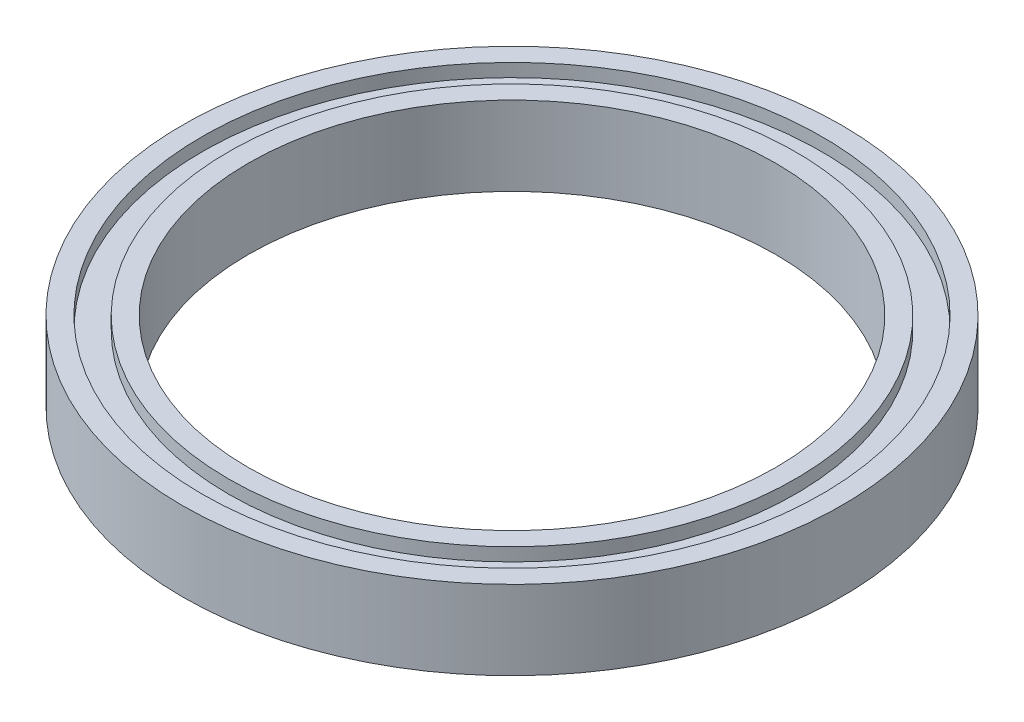
ISO-10303-21;
HEADER;
FILE_DESCRIPTION(('STEP AP214'),'2;1');
FILE_NAME('part.step','',(''),(''),'','','');
FILE_SCHEMA(('AUTOMOTIVE_DESIGN { 1 0 10303 214 1 1 1 1 }'));
ENDSEC;
DATA;
#1=APPLICATION_CONTEXT('core data for automotive mechanical design processes');
#2=APPLICATION_PROTOCOL_DEFINITION('international standard','automotive_design',2000,#1);
#3=PRODUCT_CONTEXT('',#1,'mechanical');
#4=PRODUCT('Part','Part','',(#3));
#5=PRODUCT_RELATED_PRODUCT_CATEGORY('part','',(#4));
#6=PRODUCT_DEFINITION_FORMATION('','',#4);
#7=PRODUCT_DEFINITION_CONTEXT('part definition',#1,'design');
#8=PRODUCT_DEFINITION('design','',#6,#7);
#9=PRODUCT_DEFINITION_SHAPE('','',#8);
#10=(LENGTH_UNIT() NAMED_UNIT(*) SI_UNIT(.MILLI.,.METRE.));
#11=(NAMED_UNIT(*) PLANE_ANGLE_UNIT() SI_UNIT($,.RADIAN.));
#12=(NAMED_UNIT(*) SI_UNIT($,.STERADIAN.) SOLID_ANGLE_UNIT());
#13=UNCERTAINTY_MEASURE_WITH_UNIT(LENGTH_MEASURE(1.E-05),#10,'distance_accuracy_value','');
#14=(GEOMETRIC_REPRESENTATION_CONTEXT(3) GLOBAL_UNCERTAINTY_ASSIGNED_CONTEXT((#13)) GLOBAL_UNIT_ASSIGNED_CONTEXT((#10,
#11,#12)) REPRESENTATION_CONTEXT('',''));
#15=CARTESIAN_POINT('',(0.,0.,0.));
#16=DIRECTION('',(0.,0.,1.));
#17=DIRECTION('',(1.,0.,0.));
#18=AXIS2_PLACEMENT_3D('',#15,#16,#17);
#19=CARTESIAN_POINT('',(0.,0.,0.));
#20=DIRECTION('',(0.,1.,0.));
#21=DIRECTION('',(0.,0.,1.));
#22=AXIS2_PLACEMENT_3D('',#19,#20,#21);
#23=PLANE('',#22);
#24=CARTESIAN_POINT('',(0.,0.,0.));
#25=DIRECTION('',(0.,1.,0.));
#26=DIRECTION('',(0.,0.,1.));
#27=AXIS2_PLACEMENT_3D('',#24,#25,#26);
#28=CIRCLE('',#27,20.);
#29=CARTESIAN_POINT('',(0.,0.,20.));
#30=VERTEX_POINT('',#29);
#31=EDGE_CURVE('E50',#30,#30,#28,.T.);
#32=ORIENTED_EDGE('',*,*,#31,.T.);
#33=EDGE_LOOP('',(#32));
#34=FACE_BOUND('',#33,.T.);
#35=CARTESIAN_POINT('',(0.,0.,0.));
#36=DIRECTION('',(0.,-1.,0.));
#37=DIRECTION('',(0.,0.,-1.));
#38=AXIS2_PLACEMENT_3D('',#35,#36,#37);
#39=CIRCLE('',#38,22.);
#40=CARTESIAN_POINT('',(0.,0.,-22.));
#41=VERTEX_POINT('',#40);
#42=EDGE_CURVE('E74',#41,#41,#39,.T.);
#43=ORIENTED_EDGE('',*,*,#42,.T.);
#44=EDGE_LOOP('',(#43));
#45=FACE_BOUND('',#44,.T.);
#46=ADVANCED_FACE('F37',(#34,#45),#23,.F.);
#47=CARTESIAN_POINT('',(0.,6.,0.));
#48=DIRECTION('',(0.,1.,0.));
#49=DIRECTION('',(0.,0.,1.));
#50=AXIS2_PLACEMENT_3D('',#47,#48,#49);
#51=PLANE('',#50);
#52=CARTESIAN_POINT('',(0.,6.,0.));
#53=DIRECTION('',(0.,1.,0.));
#54=DIRECTION('',(0.,0.,1.));
#55=AXIS2_PLACEMENT_3D('',#52,#53,#54);
#56=CIRCLE('',#55,20.);
#57=CARTESIAN_POINT('',(0.,6.,20.));
#58=VERTEX_POINT('',#57);
#59=EDGE_CURVE('E48',#58,#58,#56,.T.);
#60=ORIENTED_EDGE('',*,*,#59,.F.);
#61=EDGE_LOOP('',(#60));
#62=FACE_BOUND('',#61,.T.);
#63=CARTESIAN_POINT('',(0.,6.,0.));
#64=DIRECTION('',(0.,1.,0.));
#65=DIRECTION('',(0.,0.,1.));
#66=AXIS2_PLACEMENT_3D('',#63,#64,#65);
#67=CIRCLE('',#66,21.5);
#68=CARTESIAN_POINT('',(0.,6.,21.5));
#69=VERTEX_POINT('',#68);
#70=EDGE_CURVE('E62',#69,#69,#67,.T.);
#71=ORIENTED_EDGE('',*,*,#70,.T.);
#72=EDGE_LOOP('',(#71));
#73=FACE_BOUND('',#72,.T.);
#74=ADVANCED_FACE('F112',(#62,#73),#51,.T.);
#75=CARTESIAN_POINT('',(0.,6.,0.));
#76=DIRECTION('',(0.,1.,0.));
#77=DIRECTION('',(0.,0.,1.));
#78=AXIS2_PLACEMENT_3D('',#75,#76,#77);
#79=CIRCLE('',#78,23.5);
#80=CARTESIAN_POINT('',(0.,6.,23.5));
#81=VERTEX_POINT('',#80);
#82=EDGE_CURVE('E56',#81,#81,#79,.T.);
#83=ORIENTED_EDGE('',*,*,#82,.F.);
#84=EDGE_LOOP('',(#83));
#85=FACE_BOUND('',#84,.T.);
#86=CARTESIAN_POINT('',(0.,6.,0.));
#87=DIRECTION('',(0.,1.,0.));
#88=DIRECTION('',(0.,0.,1.));
#89=AXIS2_PLACEMENT_3D('',#86,#87,#88);
#90=CIRCLE('',#89,25.);
#91=CARTESIAN_POINT('',(0.,6.,25.));
#92=VERTEX_POINT('',#91);
#93=EDGE_CURVE('E10',#92,#92,#90,.T.);
#94=ORIENTED_EDGE('',*,*,#93,.T.);
#95=EDGE_LOOP('',(#94));
#96=FACE_BOUND('',#95,.T.);
#97=ADVANCED_FACE('F99',(#85,#96),#51,.T.);
#98=CARTESIAN_POINT('',(0.,0.,0.));
#99=DIRECTION('',(0.,-1.,0.));
#100=DIRECTION('',(0.,0.,-1.));
#101=AXIS2_PLACEMENT_3D('',#98,#99,#100);
#102=CIRCLE('',#101,23.);
#103=CARTESIAN_POINT('',(0.,0.,-23.));
#104=VERTEX_POINT('',#103);
#105=EDGE_CURVE('E68',#104,#104,#102,.T.);
#106=ORIENTED_EDGE('',*,*,#105,.F.);
#107=EDGE_LOOP('',(#106));
#108=FACE_BOUND('',#107,.T.);
#109=CARTESIAN_POINT('',(0.,0.,0.));
#110=DIRECTION('',(0.,1.,0.));
#111=DIRECTION('',(0.,0.,1.));
#112=AXIS2_PLACEMENT_3D('',#109,#110,#111);
#113=CIRCLE('',#112,25.);
#114=CARTESIAN_POINT('',(0.,0.,25.));
#115=VERTEX_POINT('',#114);
#116=EDGE_CURVE('E41',#115,#115,#113,.T.);
#117=ORIENTED_EDGE('',*,*,#116,.F.);
#118=EDGE_LOOP('',(#117));
#119=FACE_BOUND('',#118,.T.);
#120=ADVANCED_FACE('F96',(#108,#119),#23,.F.);
#121=CARTESIAN_POINT('',(0.,6.,0.));
#122=DIRECTION('',(0.,-1.,0.));
#123=DIRECTION('',(0.,0.,-1.));
#124=AXIS2_PLACEMENT_3D('',#121,#122,#123);
#125=CYLINDRICAL_SURFACE('',#124,25.);
#126=ORIENTED_EDGE('',*,*,#93,.F.);
#127=EDGE_LOOP('',(#126));
#128=FACE_BOUND('',#127,.T.);
#129=ORIENTED_EDGE('',*,*,#116,.T.);
#130=EDGE_LOOP('',(#129));
#131=FACE_BOUND('',#130,.T.);
#132=ADVANCED_FACE('F39',(#128,#131),#125,.T.);
#133=CARTESIAN_POINT('',(0.,6.,0.));
#134=DIRECTION('',(0.,-1.,0.));
#135=DIRECTION('',(0.,0.,-1.));
#136=AXIS2_PLACEMENT_3D('',#133,#134,#135);
#137=CYLINDRICAL_SURFACE('',#136,20.);
#138=ORIENTED_EDGE('',*,*,#59,.T.);
#139=EDGE_LOOP('',(#138));
#140=FACE_BOUND('',#139,.T.);
#141=ORIENTED_EDGE('',*,*,#31,.F.);
#142=EDGE_LOOP('',(#141));
#143=FACE_BOUND('',#142,.T.);
#144=ADVANCED_FACE('F103',(#140,#143),#137,.F.);
#145=CARTESIAN_POINT('',(0.,5.,0.));
#146=DIRECTION('',(0.,1.,0.));
#147=DIRECTION('',(0.,0.,1.));
#148=AXIS2_PLACEMENT_3D('',#145,#146,#147);
#149=CYLINDRICAL_SURFACE('',#148,23.5);
#150=CARTESIAN_POINT('',(0.,5.,0.));
#151=DIRECTION('',(0.,1.,0.));
#152=DIRECTION('',(0.,0.,1.));
#153=AXIS2_PLACEMENT_3D('',#150,#151,#152);
#154=CIRCLE('',#153,23.5);
#155=CARTESIAN_POINT('',(0.,5.,23.5));
#156=VERTEX_POINT('',#155);
#157=EDGE_CURVE('E53',#156,#156,#154,.T.);
#158=ORIENTED_EDGE('',*,*,#157,.F.);
#159=EDGE_LOOP('',(#158));
#160=FACE_BOUND('',#159,.T.);
#161=ORIENTED_EDGE('',*,*,#82,.T.);
#162=EDGE_LOOP('',(#161));
#163=FACE_BOUND('',#162,.T.);
#164=ADVANCED_FACE('F108',(#160,#163),#149,.F.);
#165=CARTESIAN_POINT('',(0.,5.,0.));
#166=DIRECTION('',(0.,1.,0.));
#167=DIRECTION('',(0.,0.,1.));
#168=AXIS2_PLACEMENT_3D('',#165,#166,#167);
#169=PLANE('',#168);
#170=CARTESIAN_POINT('',(0.,5.,0.));
#171=DIRECTION('',(0.,1.,0.));
#172=DIRECTION('',(0.,0.,1.));
#173=AXIS2_PLACEMENT_3D('',#170,#171,#172);
#174=CIRCLE('',#173,21.5);
#175=CARTESIAN_POINT('',(0.,5.,21.5));
#176=VERTEX_POINT('',#175);
#177=EDGE_CURVE('E59',#176,#176,#174,.T.);
#178=ORIENTED_EDGE('',*,*,#177,.F.);
#179=EDGE_LOOP('',(#178));
#180=FACE_BOUND('',#179,.T.);
#181=ORIENTED_EDGE('',*,*,#157,.T.);
#182=EDGE_LOOP('',(#181));
#183=FACE_BOUND('',#182,.T.);
#184=ADVANCED_FACE('F125',(#180,#183),#169,.T.);
#185=CARTESIAN_POINT('',(0.,5.,0.));
#186=DIRECTION('',(0.,1.,0.));
#187=DIRECTION('',(0.,0.,1.));
#188=AXIS2_PLACEMENT_3D('',#185,#186,#187);
#189=CYLINDRICAL_SURFACE('',#188,21.5);
#190=ORIENTED_EDGE('',*,*,#177,.T.);
#191=EDGE_LOOP('',(#190));
#192=FACE_BOUND('',#191,.T.);
#193=ORIENTED_EDGE('',*,*,#70,.F.);
#194=EDGE_LOOP('',(#193));
#195=FACE_BOUND('',#194,.T.);
#196=ADVANCED_FACE('F92',(#192,#195),#189,.T.);
#197=CARTESIAN_POINT('',(0.,1.,0.));
#198=DIRECTION('',(0.,-1.,0.));
#199=DIRECTION('',(0.,0.,-1.));
#200=AXIS2_PLACEMENT_3D('',#197,#198,#199);
#201=CYLINDRICAL_SURFACE('',#200,23.);
#202=CARTESIAN_POINT('',(0.,1.,0.));
#203=DIRECTION('',(0.,-1.,0.));
#204=DIRECTION('',(0.,0.,-1.));
#205=AXIS2_PLACEMENT_3D('',#202,#203,#204);
#206=CIRCLE('',#205,23.);
#207=CARTESIAN_POINT('',(0.,1.,-23.));
#208=VERTEX_POINT('',#207);
#209=EDGE_CURVE('E65',#208,#208,#206,.T.);
#210=ORIENTED_EDGE('',*,*,#209,.F.);
#211=EDGE_LOOP('',(#210));
#212=FACE_BOUND('',#211,.T.);
#213=ORIENTED_EDGE('',*,*,#105,.T.);
#214=EDGE_LOOP('',(#213));
#215=FACE_BOUND('',#214,.T.);
#216=ADVANCED_FACE('F86',(#212,#215),#201,.F.);
#217=CARTESIAN_POINT('',(0.,1.,0.));
#218=DIRECTION('',(0.,-1.,0.));
#219=DIRECTION('',(0.,0.,-1.));
#220=AXIS2_PLACEMENT_3D('',#217,#218,#219);
#221=PLANE('',#220);
#222=CARTESIAN_POINT('',(0.,1.,0.));
#223=DIRECTION('',(0.,-1.,0.));
#224=DIRECTION('',(0.,0.,-1.));
#225=AXIS2_PLACEMENT_3D('',#222,#223,#224);
#226=CIRCLE('',#225,22.);
#227=CARTESIAN_POINT('',(0.,1.,-22.));
#228=VERTEX_POINT('',#227);
#229=EDGE_CURVE('E71',#228,#228,#226,.T.);
#230=ORIENTED_EDGE('',*,*,#229,.F.);
#231=EDGE_LOOP('',(#230));
#232=FACE_BOUND('',#231,.T.);
#233=ORIENTED_EDGE('',*,*,#209,.T.);
#234=EDGE_LOOP('',(#233));
#235=FACE_BOUND('',#234,.T.);
#236=ADVANCED_FACE('F83',(#232,#235),#221,.T.);
#237=CARTESIAN_POINT('',(0.,1.,0.));
#238=DIRECTION('',(0.,-1.,0.));
#239=DIRECTION('',(0.,0.,-1.));
#240=AXIS2_PLACEMENT_3D('',#237,#238,#239);
#241=CYLINDRICAL_SURFACE('',#240,22.);
#242=ORIENTED_EDGE('',*,*,#229,.T.);
#243=EDGE_LOOP('',(#242));
#244=FACE_BOUND('',#243,.T.);
#245=ORIENTED_EDGE('',*,*,#42,.F.);
#246=EDGE_LOOP('',(#245));
#247=FACE_BOUND('',#246,.T.);
#248=ADVANCED_FACE('F80',(#244,#247),#241,.T.);
#249=CLOSED_SHELL('',(#46,#74,#97,#120,#132,#144,#164,#184,#196,#216,#236,#248));
#250=MANIFOLD_SOLID_BREP('B2',#249);
#251=ADVANCED_BREP_SHAPE_REPRESENTATION('',(#18,#250),#14);
#252=SHAPE_DEFINITION_REPRESENTATION(#9,#251);
ENDSEC;
END-ISO-10303-21;
